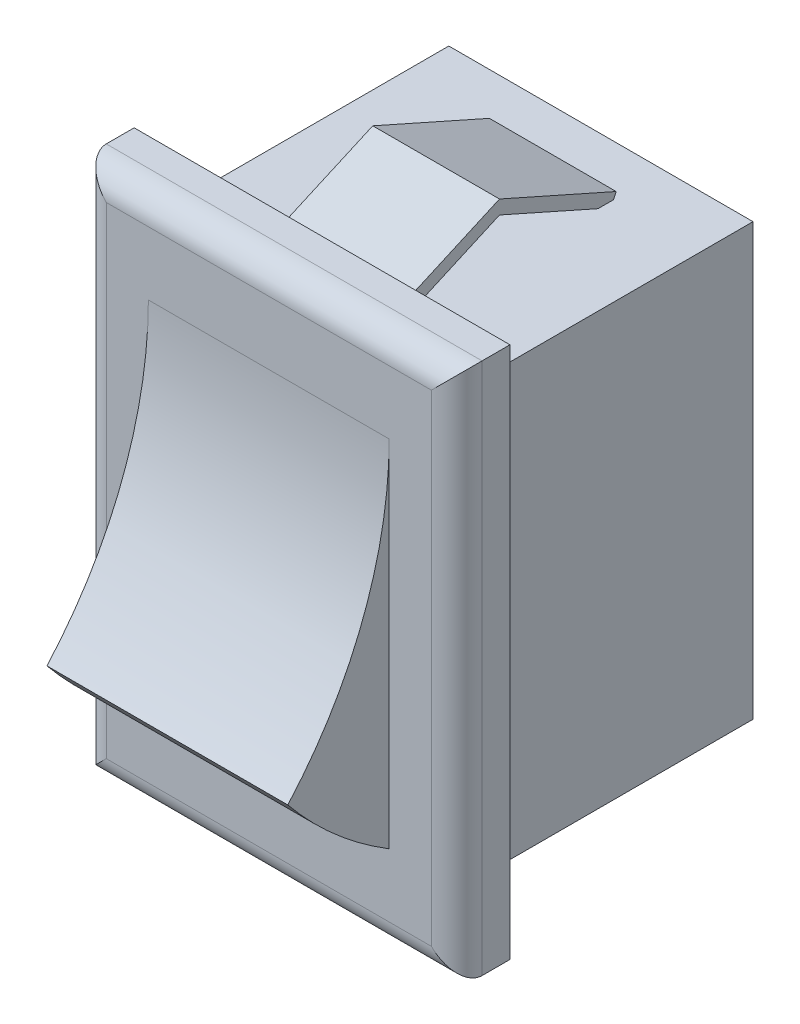
ISO-10303-21;
HEADER;
FILE_DESCRIPTION(('STEP AP214'),'2;1');
FILE_NAME('part.step','',(''),(''),'','','');
FILE_SCHEMA(('AUTOMOTIVE_DESIGN { 1 0 10303 214 1 1 1 1 }'));
ENDSEC;
DATA;
#1=APPLICATION_CONTEXT('core data for automotive mechanical design processes');
#2=APPLICATION_PROTOCOL_DEFINITION('international standard','automotive_design',2000,#1);
#3=PRODUCT_CONTEXT('',#1,'mechanical');
#4=PRODUCT('Part','Part','',(#3));
#5=PRODUCT_RELATED_PRODUCT_CATEGORY('part','',(#4));
#6=PRODUCT_DEFINITION_FORMATION('','',#4);
#7=PRODUCT_DEFINITION_CONTEXT('part definition',#1,'design');
#8=PRODUCT_DEFINITION('design','',#6,#7);
#9=PRODUCT_DEFINITION_SHAPE('','',#8);
#10=(LENGTH_UNIT() NAMED_UNIT(*) SI_UNIT(.MILLI.,.METRE.));
#11=(NAMED_UNIT(*) PLANE_ANGLE_UNIT() SI_UNIT($,.RADIAN.));
#12=(NAMED_UNIT(*) SI_UNIT($,.STERADIAN.) SOLID_ANGLE_UNIT());
#13=UNCERTAINTY_MEASURE_WITH_UNIT(LENGTH_MEASURE(1.E-05),#10,'distance_accuracy_value','');
#14=(GEOMETRIC_REPRESENTATION_CONTEXT(3) GLOBAL_UNCERTAINTY_ASSIGNED_CONTEXT((#13)) GLOBAL_UNIT_ASSIGNED_CONTEXT((#10,
#11,#12)) REPRESENTATION_CONTEXT('',''));
#15=CARTESIAN_POINT('',(0.,0.,0.));
#16=DIRECTION('',(0.,0.,1.));
#17=DIRECTION('',(1.,0.,0.));
#18=AXIS2_PLACEMENT_3D('',#15,#16,#17);
#19=CARTESIAN_POINT('',(0.,0.,11.));
#20=DIRECTION('',(0.,0.,-1.));
#21=DIRECTION('',(-1.,0.,0.));
#22=AXIS2_PLACEMENT_3D('',#19,#20,#21);
#23=PLANE('',#22);
#24=DIRECTION('',(0.,1.,0.));
#25=VECTOR('',#24,1.);
#26=CARTESIAN_POINT('',(7.41176470588235,-10.5,11.));
#27=LINE('',#26,#25);
#28=CARTESIAN_POINT('',(7.41176470588235,-10.5,11.));
#29=VERTEX_POINT('',#28);
#30=CARTESIAN_POINT('',(7.41176470588235,10.5,11.));
#31=VERTEX_POINT('',#30);
#32=EDGE_CURVE('E340',#29,#31,#27,.T.);
#33=ORIENTED_EDGE('',*,*,#32,.F.);
#34=DIRECTION('',(1.,0.,0.));
#35=VECTOR('',#34,1.);
#36=CARTESIAN_POINT('',(-7.41176470588235,-10.5,11.));
#37=LINE('',#36,#35);
#38=CARTESIAN_POINT('',(-7.41176470588235,-10.5,11.));
#39=VERTEX_POINT('',#38);
#40=EDGE_CURVE('E349',#39,#29,#37,.T.);
#41=ORIENTED_EDGE('',*,*,#40,.F.);
#42=DIRECTION('',(0.,-1.,0.));
#43=VECTOR('',#42,1.);
#44=CARTESIAN_POINT('',(-7.41176470588235,-10.5,11.));
#45=LINE('',#44,#43);
#46=CARTESIAN_POINT('',(-7.41176470588235,10.5,11.));
#47=VERTEX_POINT('',#46);
#48=EDGE_CURVE('E346',#47,#39,#45,.T.);
#49=ORIENTED_EDGE('',*,*,#48,.F.);
#50=DIRECTION('',(-1.,0.,0.));
#51=VECTOR('',#50,1.);
#52=CARTESIAN_POINT('',(-7.41176470588235,10.5,11.));
#53=LINE('',#52,#51);
#54=EDGE_CURVE('E343',#31,#47,#53,.T.);
#55=ORIENTED_EDGE('',*,*,#54,.F.);
#56=EDGE_LOOP('',(#33,#41,#49,#55));
#57=FACE_BOUND('',#56,.T.);
#58=DIRECTION('',(-1.,0.,0.));
#59=VECTOR('',#58,1.);
#60=CARTESIAN_POINT('',(-6.,8.5,11.));
#61=LINE('',#60,#59);
#62=CARTESIAN_POINT('',(6.,8.5,11.));
#63=VERTEX_POINT('',#62);
#64=CARTESIAN_POINT('',(2.5,8.5,11.));
#65=VERTEX_POINT('',#64);
#66=EDGE_CURVE('E372',#63,#65,#61,.T.);
#67=ORIENTED_EDGE('',*,*,#66,.T.);
#68=DIRECTION('',(0.,1.,0.));
#69=VECTOR('',#68,1.);
#70=CARTESIAN_POINT('',(2.5,0.,11.));
#71=LINE('',#70,#69);
#72=CARTESIAN_POINT('',(2.5,8.77357938338323,11.));
#73=VERTEX_POINT('',#72);
#74=EDGE_CURVE('E274',#65,#73,#71,.T.);
#75=ORIENTED_EDGE('',*,*,#74,.T.);
#76=DIRECTION('',(1.,0.,0.));
#77=VECTOR('',#76,1.);
#78=CARTESIAN_POINT('',(0.,8.77357938338323,11.));
#79=LINE('',#78,#77);
#80=CARTESIAN_POINT('',(-2.5,8.77357938338323,11.));
#81=VERTEX_POINT('',#80);
#82=EDGE_CURVE('E422',#81,#73,#79,.T.);
#83=ORIENTED_EDGE('',*,*,#82,.F.);
#84=DIRECTION('',(0.,1.,0.));
#85=VECTOR('',#84,1.);
#86=CARTESIAN_POINT('',(-2.5,0.,11.));
#87=LINE('',#86,#85);
#88=CARTESIAN_POINT('',(-2.5,8.5,11.));
#89=VERTEX_POINT('',#88);
#90=EDGE_CURVE('E236',#89,#81,#87,.T.);
#91=ORIENTED_EDGE('',*,*,#90,.F.);
#92=CARTESIAN_POINT('',(-6.,8.5,11.));
#93=VERTEX_POINT('',#92);
#94=EDGE_CURVE('E371',#89,#93,#61,.T.);
#95=ORIENTED_EDGE('',*,*,#94,.T.);
#96=DIRECTION('',(0.,-1.,0.));
#97=VECTOR('',#96,1.);
#98=CARTESIAN_POINT('',(-6.,-8.5,11.));
#99=LINE('',#98,#97);
#100=CARTESIAN_POINT('',(-6.,-8.5,11.));
#101=VERTEX_POINT('',#100);
#102=EDGE_CURVE('E361',#93,#101,#99,.T.);
#103=ORIENTED_EDGE('',*,*,#102,.T.);
#104=DIRECTION('',(1.,0.,0.));
#105=VECTOR('',#104,1.);
#106=CARTESIAN_POINT('',(-6.,-8.5,11.));
#107=LINE('',#106,#105);
#108=CARTESIAN_POINT('',(-2.5,-8.5,11.));
#109=VERTEX_POINT('',#108);
#110=EDGE_CURVE('E366',#101,#109,#107,.T.);
#111=ORIENTED_EDGE('',*,*,#110,.T.);
#112=DIRECTION('',(0.,1.,0.));
#113=VECTOR('',#112,1.);
#114=CARTESIAN_POINT('',(-2.5,0.,11.));
#115=LINE('',#114,#113);
#116=CARTESIAN_POINT('',(-2.5,-8.77357938338323,11.));
#117=VERTEX_POINT('',#116);
#118=EDGE_CURVE('E394',#117,#109,#115,.T.);
#119=ORIENTED_EDGE('',*,*,#118,.F.);
#120=DIRECTION('',(1.,0.,0.));
#121=VECTOR('',#120,1.);
#122=CARTESIAN_POINT('',(0.,-8.77357938338323,11.));
#123=LINE('',#122,#121);
#124=CARTESIAN_POINT('',(2.5,-8.77357938338323,11.));
#125=VERTEX_POINT('',#124);
#126=EDGE_CURVE('E397',#117,#125,#123,.T.);
#127=ORIENTED_EDGE('',*,*,#126,.T.);
#128=DIRECTION('',(0.,1.,0.));
#129=VECTOR('',#128,1.);
#130=CARTESIAN_POINT('',(2.5,0.,11.));
#131=LINE('',#130,#129);
#132=CARTESIAN_POINT('',(2.5,-8.5,11.));
#133=VERTEX_POINT('',#132);
#134=EDGE_CURVE('E399',#125,#133,#131,.T.);
#135=ORIENTED_EDGE('',*,*,#134,.T.);
#136=CARTESIAN_POINT('',(6.,-8.5,11.));
#137=VERTEX_POINT('',#136);
#138=EDGE_CURVE('E364',#133,#137,#107,.T.);
#139=ORIENTED_EDGE('',*,*,#138,.T.);
#140=DIRECTION('',(0.,1.,0.));
#141=VECTOR('',#140,1.);
#142=CARTESIAN_POINT('',(6.,-8.5,11.));
#143=LINE('',#142,#141);
#144=EDGE_CURVE('E368',#137,#63,#143,.T.);
#145=ORIENTED_EDGE('',*,*,#144,.T.);
#146=EDGE_LOOP('',(#67,#75,#83,#91,#95,#103,#111,#119,#127,#135,#139,#145));
#147=FACE_BOUND('',#146,.T.);
#148=ADVANCED_FACE('F33',(#57,#147),#23,.T.);
#149=CARTESIAN_POINT('',(-6.,8.5,11.));
#150=DIRECTION('',(0.,-1.,0.));
#151=DIRECTION('',(0.,0.,-1.));
#152=AXIS2_PLACEMENT_3D('',#149,#150,#151);
#153=PLANE('',#152);
#154=DIRECTION('',(0.,0.,-1.));
#155=VECTOR('',#154,1.);
#156=CARTESIAN_POINT('',(2.5,8.5,11.));
#157=LINE('',#156,#155);
#158=CARTESIAN_POINT('',(2.5,8.5,2.61555361261226));
#159=VERTEX_POINT('',#158);
#160=CARTESIAN_POINT('',(2.5,8.5,2.));
#161=VERTEX_POINT('',#160);
#162=EDGE_CURVE('E246',#159,#161,#157,.T.);
#163=ORIENTED_EDGE('',*,*,#162,.F.);
#164=DIRECTION('',(1.,0.,0.));
#165=VECTOR('',#164,1.);
#166=CARTESIAN_POINT('',(-6.,8.5,2.61555361261226));
#167=LINE('',#166,#165);
#168=CARTESIAN_POINT('',(-2.5,8.5,2.61555361261226));
#169=VERTEX_POINT('',#168);
#170=EDGE_CURVE('E415',#169,#159,#167,.T.);
#171=ORIENTED_EDGE('',*,*,#170,.F.);
#172=DIRECTION('',(0.,0.,-1.));
#173=VECTOR('',#172,1.);
#174=CARTESIAN_POINT('',(-2.5,8.5,11.));
#175=LINE('',#174,#173);
#176=CARTESIAN_POINT('',(-2.5,8.5,2.));
#177=VERTEX_POINT('',#176);
#178=EDGE_CURVE('E409',#169,#177,#175,.T.);
#179=ORIENTED_EDGE('',*,*,#178,.T.);
#180=DIRECTION('',(1.,0.,0.));
#181=VECTOR('',#180,1.);
#182=CARTESIAN_POINT('',(-6.,8.5,2.));
#183=LINE('',#182,#181);
#184=EDGE_CURVE('E412',#177,#161,#183,.T.);
#185=ORIENTED_EDGE('',*,*,#184,.T.);
#186=EDGE_LOOP('',(#163,#171,#179,#185));
#187=FACE_BOUND('',#186,.T.);
#188=CARTESIAN_POINT('',(2.5,8.5,10.3844463873877));
#189=VERTEX_POINT('',#188);
#190=EDGE_CURVE('E418',#65,#189,#157,.T.);
#191=ORIENTED_EDGE('',*,*,#190,.F.);
#192=ORIENTED_EDGE('',*,*,#66,.F.);
#193=DIRECTION('',(0.,0.,-1.));
#194=VECTOR('',#193,1.);
#195=CARTESIAN_POINT('',(6.,8.5,11.));
#196=LINE('',#195,#194);
#197=CARTESIAN_POINT('',(6.,8.5,0.));
#198=VERTEX_POINT('',#197);
#199=EDGE_CURVE('E385',#63,#198,#196,.T.);
#200=ORIENTED_EDGE('',*,*,#199,.T.);
#201=DIRECTION('',(-1.,0.,0.));
#202=VECTOR('',#201,1.);
#203=CARTESIAN_POINT('',(-6.,8.5,0.));
#204=LINE('',#203,#202);
#205=CARTESIAN_POINT('',(-6.,8.5,0.));
#206=VERTEX_POINT('',#205);
#207=EDGE_CURVE('E365',#198,#206,#204,.T.);
#208=ORIENTED_EDGE('',*,*,#207,.T.);
#209=DIRECTION('',(0.,0.,-1.));
#210=VECTOR('',#209,1.);
#211=CARTESIAN_POINT('',(-6.,8.5,11.));
#212=LINE('',#211,#210);
#213=EDGE_CURVE('E375',#93,#206,#212,.T.);
#214=ORIENTED_EDGE('',*,*,#213,.F.);
#215=ORIENTED_EDGE('',*,*,#94,.F.);
#216=CARTESIAN_POINT('',(-2.5,8.5,10.3844463873877));
#217=VERTEX_POINT('',#216);
#218=EDGE_CURVE('E413',#89,#217,#175,.T.);
#219=ORIENTED_EDGE('',*,*,#218,.T.);
#220=DIRECTION('',(-1.,0.,0.));
#221=VECTOR('',#220,1.);
#222=CARTESIAN_POINT('',(-6.,8.5,10.3844463873877));
#223=LINE('',#222,#221);
#224=EDGE_CURVE('E419',#189,#217,#223,.T.);
#225=ORIENTED_EDGE('',*,*,#224,.F.);
#226=EDGE_LOOP('',(#191,#192,#200,#208,#214,#215,#219,#225));
#227=FACE_BOUND('',#226,.T.);
#228=ADVANCED_FACE('F501',(#187,#227),#153,.F.);
#229=CARTESIAN_POINT('',(-6.,-8.5,11.));
#230=DIRECTION('',(0.,1.,0.));
#231=DIRECTION('',(0.,0.,1.));
#232=AXIS2_PLACEMENT_3D('',#229,#230,#231);
#233=PLANE('',#232);
#234=DIRECTION('',(0.,0.,1.));
#235=VECTOR('',#234,1.);
#236=CARTESIAN_POINT('',(2.5,-8.5,11.));
#237=LINE('',#236,#235);
#238=CARTESIAN_POINT('',(2.5,-8.5,10.3844463873877));
#239=VERTEX_POINT('',#238);
#240=EDGE_CURVE('E313',#239,#133,#237,.T.);
#241=ORIENTED_EDGE('',*,*,#240,.F.);
#242=DIRECTION('',(-1.,0.,0.));
#243=VECTOR('',#242,1.);
#244=CARTESIAN_POINT('',(-6.,-8.5,10.3844463873877));
#245=LINE('',#244,#243);
#246=CARTESIAN_POINT('',(-2.5,-8.5,10.3844463873877));
#247=VERTEX_POINT('',#246);
#248=EDGE_CURVE('E401',#239,#247,#245,.T.);
#249=ORIENTED_EDGE('',*,*,#248,.T.);
#250=DIRECTION('',(0.,0.,1.));
#251=VECTOR('',#250,1.);
#252=CARTESIAN_POINT('',(-2.5,-8.5,11.));
#253=LINE('',#252,#251);
#254=EDGE_CURVE('E309',#247,#109,#253,.T.);
#255=ORIENTED_EDGE('',*,*,#254,.T.);
#256=ORIENTED_EDGE('',*,*,#110,.F.);
#257=DIRECTION('',(0.,0.,-1.));
#258=VECTOR('',#257,1.);
#259=CARTESIAN_POINT('',(-6.,-8.5,11.));
#260=LINE('',#259,#258);
#261=CARTESIAN_POINT('',(-6.,-8.5,0.));
#262=VERTEX_POINT('',#261);
#263=EDGE_CURVE('E391',#101,#262,#260,.T.);
#264=ORIENTED_EDGE('',*,*,#263,.T.);
#265=DIRECTION('',(1.,0.,0.));
#266=VECTOR('',#265,1.);
#267=CARTESIAN_POINT('',(-6.,-8.5,0.));
#268=LINE('',#267,#266);
#269=CARTESIAN_POINT('',(6.,-8.5,0.));
#270=VERTEX_POINT('',#269);
#271=EDGE_CURVE('E378',#262,#270,#268,.T.);
#272=ORIENTED_EDGE('',*,*,#271,.T.);
#273=DIRECTION('',(0.,0.,-1.));
#274=VECTOR('',#273,1.);
#275=CARTESIAN_POINT('',(6.,-8.5,11.));
#276=LINE('',#275,#274);
#277=EDGE_CURVE('E388',#137,#270,#276,.T.);
#278=ORIENTED_EDGE('',*,*,#277,.F.);
#279=ORIENTED_EDGE('',*,*,#138,.F.);
#280=EDGE_LOOP('',(#241,#249,#255,#256,#264,#272,#278,#279));
#281=FACE_BOUND('',#280,.T.);
#282=CARTESIAN_POINT('',(2.5,-8.5,2.));
#283=VERTEX_POINT('',#282);
#284=CARTESIAN_POINT('',(2.5,-8.5,2.61555361261226));
#285=VERTEX_POINT('',#284);
#286=EDGE_CURVE('E316',#283,#285,#237,.T.);
#287=ORIENTED_EDGE('',*,*,#286,.F.);
#288=DIRECTION('',(-1.,0.,0.));
#289=VECTOR('',#288,1.);
#290=CARTESIAN_POINT('',(-6.,-8.5,2.));
#291=LINE('',#290,#289);
#292=CARTESIAN_POINT('',(-2.5,-8.5,2.));
#293=VERTEX_POINT('',#292);
#294=EDGE_CURVE('E406',#283,#293,#291,.T.);
#295=ORIENTED_EDGE('',*,*,#294,.T.);
#296=CARTESIAN_POINT('',(-2.5,-8.5,2.61555361261226));
#297=VERTEX_POINT('',#296);
#298=EDGE_CURVE('E312',#293,#297,#253,.T.);
#299=ORIENTED_EDGE('',*,*,#298,.T.);
#300=DIRECTION('',(1.,0.,0.));
#301=VECTOR('',#300,1.);
#302=CARTESIAN_POINT('',(-6.,-8.5,2.61555361261225));
#303=LINE('',#302,#301);
#304=EDGE_CURVE('E403',#297,#285,#303,.T.);
#305=ORIENTED_EDGE('',*,*,#304,.T.);
#306=EDGE_LOOP('',(#287,#295,#299,#305));
#307=FACE_BOUND('',#306,.T.);
#308=ADVANCED_FACE('F507',(#281,#307),#233,.F.);
#309=CARTESIAN_POINT('',(-6.,-8.5,11.));
#310=DIRECTION('',(1.,0.,0.));
#311=DIRECTION('',(0.,0.,-1.));
#312=AXIS2_PLACEMENT_3D('',#309,#310,#311);
#313=PLANE('',#312);
#314=DIRECTION('',(0.,-1.,0.));
#315=VECTOR('',#314,1.);
#316=CARTESIAN_POINT('',(-6.,-8.5,0.));
#317=LINE('',#316,#315);
#318=EDGE_CURVE('E360',#206,#262,#317,.T.);
#319=ORIENTED_EDGE('',*,*,#318,.T.);
#320=ORIENTED_EDGE('',*,*,#263,.F.);
#321=ORIENTED_EDGE('',*,*,#102,.F.);
#322=ORIENTED_EDGE('',*,*,#213,.T.);
#323=EDGE_LOOP('',(#319,#320,#321,#322));
#324=FACE_BOUND('',#323,.T.);
#325=ADVANCED_FACE('F530',(#324),#313,.F.);
#326=CARTESIAN_POINT('',(6.,-8.5,11.));
#327=DIRECTION('',(-1.,0.,0.));
#328=DIRECTION('',(0.,0.,1.));
#329=AXIS2_PLACEMENT_3D('',#326,#327,#328);
#330=PLANE('',#329);
#331=DIRECTION('',(0.,1.,0.));
#332=VECTOR('',#331,1.);
#333=CARTESIAN_POINT('',(6.,-8.5,0.));
#334=LINE('',#333,#332);
#335=EDGE_CURVE('E380',#270,#198,#334,.T.);
#336=ORIENTED_EDGE('',*,*,#335,.T.);
#337=ORIENTED_EDGE('',*,*,#199,.F.);
#338=ORIENTED_EDGE('',*,*,#144,.F.);
#339=ORIENTED_EDGE('',*,*,#277,.T.);
#340=EDGE_LOOP('',(#336,#337,#338,#339));
#341=FACE_BOUND('',#340,.T.);
#342=ADVANCED_FACE('F525',(#341),#330,.F.);
#343=CARTESIAN_POINT('',(0.,0.,0.));
#344=DIRECTION('',(0.,0.,-1.));
#345=DIRECTION('',(-1.,0.,0.));
#346=AXIS2_PLACEMENT_3D('',#343,#344,#345);
#347=PLANE('',#346);
#348=ORIENTED_EDGE('',*,*,#318,.F.);
#349=ORIENTED_EDGE('',*,*,#207,.F.);
#350=ORIENTED_EDGE('',*,*,#335,.F.);
#351=ORIENTED_EDGE('',*,*,#271,.F.);
#352=EDGE_LOOP('',(#348,#349,#350,#351));
#353=FACE_BOUND('',#352,.T.);
#354=ADVANCED_FACE('F523',(#353),#347,.T.);
#355=CARTESIAN_POINT('',(7.41176470588235,-10.5,13.1));
#356=DIRECTION('',(-1.,0.,0.));
#357=DIRECTION('',(0.,0.,1.));
#358=AXIS2_PLACEMENT_3D('',#355,#356,#357);
#359=PLANE('',#358);
#360=DIRECTION('',(0.,0.,-1.));
#361=VECTOR('',#360,1.);
#362=CARTESIAN_POINT('',(7.41176470588235,10.5,13.1));
#363=LINE('',#362,#361);
#364=CARTESIAN_POINT('',(7.41176470588235,10.5,12.1));
#365=VERTEX_POINT('',#364);
#366=EDGE_CURVE('E358',#365,#31,#363,.T.);
#367=ORIENTED_EDGE('',*,*,#366,.F.);
#368=DIRECTION('',(0.,1.,0.));
#369=VECTOR('',#368,1.);
#370=CARTESIAN_POINT('',(7.41176470588235,-10.5,12.1));
#371=LINE('',#370,#369);
#372=CARTESIAN_POINT('',(7.41176470588235,-10.5,12.1));
#373=VERTEX_POINT('',#372);
#374=EDGE_CURVE('E42',#365,#373,#371,.F.);
#375=ORIENTED_EDGE('',*,*,#374,.T.);
#376=DIRECTION('',(0.,0.,-1.));
#377=VECTOR('',#376,1.);
#378=CARTESIAN_POINT('',(7.41176470588235,-10.5,13.1));
#379=LINE('',#378,#377);
#380=EDGE_CURVE('E352',#373,#29,#379,.T.);
#381=ORIENTED_EDGE('',*,*,#380,.T.);
#382=ORIENTED_EDGE('',*,*,#32,.T.);
#383=EDGE_LOOP('',(#367,#375,#381,#382));
#384=FACE_BOUND('',#383,.T.);
#385=ADVANCED_FACE('F459',(#384),#359,.F.);
#386=CARTESIAN_POINT('',(-7.41176470588235,10.5,13.1));
#387=DIRECTION('',(0.,-1.,0.));
#388=DIRECTION('',(1.,0.,0.));
#389=AXIS2_PLACEMENT_3D('',#386,#387,#388);
#390=PLANE('',#389);
#391=DIRECTION('',(0.,0.,-1.));
#392=VECTOR('',#391,1.);
#393=CARTESIAN_POINT('',(-7.41176470588235,10.5,13.1));
#394=LINE('',#393,#392);
#395=CARTESIAN_POINT('',(-7.41176470588235,10.5,12.1));
#396=VERTEX_POINT('',#395);
#397=EDGE_CURVE('E356',#396,#47,#394,.T.);
#398=ORIENTED_EDGE('',*,*,#397,.F.);
#399=DIRECTION('',(-1.,0.,0.));
#400=VECTOR('',#399,1.);
#401=CARTESIAN_POINT('',(-7.41176470588235,10.5,12.1));
#402=LINE('',#401,#400);
#403=EDGE_CURVE('E11',#396,#365,#402,.F.);
#404=ORIENTED_EDGE('',*,*,#403,.T.);
#405=ORIENTED_EDGE('',*,*,#366,.T.);
#406=ORIENTED_EDGE('',*,*,#54,.T.);
#407=EDGE_LOOP('',(#398,#404,#405,#406));
#408=FACE_BOUND('',#407,.T.);
#409=ADVANCED_FACE('F518',(#408),#390,.F.);
#410=CARTESIAN_POINT('',(-7.41176470588235,-10.5,13.1));
#411=DIRECTION('',(1.,0.,0.));
#412=DIRECTION('',(0.,0.,-1.));
#413=AXIS2_PLACEMENT_3D('',#410,#411,#412);
#414=PLANE('',#413);
#415=DIRECTION('',(0.,0.,-1.));
#416=VECTOR('',#415,1.);
#417=CARTESIAN_POINT('',(-7.41176470588235,-10.5,13.1));
#418=LINE('',#417,#416);
#419=CARTESIAN_POINT('',(-7.41176470588235,-10.5,12.1));
#420=VERTEX_POINT('',#419);
#421=EDGE_CURVE('E354',#420,#39,#418,.T.);
#422=ORIENTED_EDGE('',*,*,#421,.F.);
#423=DIRECTION('',(0.,-1.,0.));
#424=VECTOR('',#423,1.);
#425=CARTESIAN_POINT('',(-7.41176470588235,-10.5,12.1));
#426=LINE('',#425,#424);
#427=EDGE_CURVE('E56',#420,#396,#426,.F.);
#428=ORIENTED_EDGE('',*,*,#427,.T.);
#429=ORIENTED_EDGE('',*,*,#397,.T.);
#430=ORIENTED_EDGE('',*,*,#48,.T.);
#431=EDGE_LOOP('',(#422,#428,#429,#430));
#432=FACE_BOUND('',#431,.T.);
#433=ADVANCED_FACE('F515',(#432),#414,.F.);
#434=CARTESIAN_POINT('',(-7.41176470588235,-10.5,13.1));
#435=DIRECTION('',(0.,1.,0.));
#436=DIRECTION('',(-1.,0.,0.));
#437=AXIS2_PLACEMENT_3D('',#434,#435,#436);
#438=PLANE('',#437);
#439=ORIENTED_EDGE('',*,*,#380,.F.);
#440=DIRECTION('',(1.,0.,0.));
#441=VECTOR('',#440,1.);
#442=CARTESIAN_POINT('',(-7.41176470588235,-10.5,12.1));
#443=LINE('',#442,#441);
#444=EDGE_CURVE('E433',#373,#420,#443,.F.);
#445=ORIENTED_EDGE('',*,*,#444,.T.);
#446=ORIENTED_EDGE('',*,*,#421,.T.);
#447=ORIENTED_EDGE('',*,*,#40,.T.);
#448=EDGE_LOOP('',(#439,#445,#446,#447));
#449=FACE_BOUND('',#448,.T.);
#450=ADVANCED_FACE('F462',(#449),#438,.F.);
#451=CARTESIAN_POINT('',(0.,0.,13.1));
#452=DIRECTION('',(0.,0.,-1.));
#453=DIRECTION('',(-1.,0.,0.));
#454=AXIS2_PLACEMENT_3D('',#451,#452,#453);
#455=PLANE('',#454);
#456=DIRECTION('',(0.,-1.,0.));
#457=VECTOR('',#456,1.);
#458=CARTESIAN_POINT('',(-6.41176470588235,0.,13.1));
#459=LINE('',#458,#457);
#460=CARTESIAN_POINT('',(-6.41176470588235,9.50000000000001,13.1));
#461=VERTEX_POINT('',#460);
#462=CARTESIAN_POINT('',(-6.41176470588235,-9.5,13.1));
#463=VERTEX_POINT('',#462);
#464=EDGE_CURVE('E428',#461,#463,#459,.T.);
#465=ORIENTED_EDGE('',*,*,#464,.T.);
#466=DIRECTION('',(1.,0.,0.));
#467=VECTOR('',#466,1.);
#468=CARTESIAN_POINT('',(0.,-9.5,13.1));
#469=LINE('',#468,#467);
#470=CARTESIAN_POINT('',(6.41176470588235,-9.49999999999999,13.1));
#471=VERTEX_POINT('',#470);
#472=EDGE_CURVE('E430',#463,#471,#469,.T.);
#473=ORIENTED_EDGE('',*,*,#472,.T.);
#474=DIRECTION('',(0.,1.,0.));
#475=VECTOR('',#474,1.);
#476=CARTESIAN_POINT('',(6.41176470588235,0.,13.1));
#477=LINE('',#476,#475);
#478=CARTESIAN_POINT('',(6.41176470588235,9.5,13.1));
#479=VERTEX_POINT('',#478);
#480=EDGE_CURVE('E426',#471,#479,#477,.T.);
#481=ORIENTED_EDGE('',*,*,#480,.T.);
#482=DIRECTION('',(-1.,0.,0.));
#483=VECTOR('',#482,1.);
#484=CARTESIAN_POINT('',(0.,9.5,13.1));
#485=LINE('',#484,#483);
#486=EDGE_CURVE('E424',#479,#461,#485,.T.);
#487=ORIENTED_EDGE('',*,*,#486,.T.);
#488=EDGE_LOOP('',(#465,#473,#481,#487));
#489=FACE_BOUND('',#488,.T.);
#490=DIRECTION('',(-1.,0.,0.));
#491=VECTOR('',#490,1.);
#492=CARTESIAN_POINT('',(4.75,7.,13.1));
#493=LINE('',#492,#491);
#494=CARTESIAN_POINT('',(4.75,7.,13.1));
#495=VERTEX_POINT('',#494);
#496=CARTESIAN_POINT('',(-4.75,7.,13.1));
#497=VERTEX_POINT('',#496);
#498=EDGE_CURVE('E335',#495,#497,#493,.T.);
#499=ORIENTED_EDGE('',*,*,#498,.F.);
#500=DIRECTION('',(0.,1.,0.));
#501=VECTOR('',#500,1.);
#502=CARTESIAN_POINT('',(4.75,-7.,13.1));
#503=LINE('',#502,#501);
#504=CARTESIAN_POINT('',(4.75,-7.,13.1));
#505=VERTEX_POINT('',#504);
#506=EDGE_CURVE('E320',#505,#495,#503,.T.);
#507=ORIENTED_EDGE('',*,*,#506,.F.);
#508=DIRECTION('',(-1.,0.,0.));
#509=VECTOR('',#508,1.);
#510=CARTESIAN_POINT('',(4.75,-7.,13.1));
#511=LINE('',#510,#509);
#512=CARTESIAN_POINT('',(-4.75,-7.,13.1));
#513=VERTEX_POINT('',#512);
#514=EDGE_CURVE('E338',#505,#513,#511,.T.);
#515=ORIENTED_EDGE('',*,*,#514,.T.);
#516=DIRECTION('',(0.,1.,0.));
#517=VECTOR('',#516,1.);
#518=CARTESIAN_POINT('',(-4.75,-7.,13.1));
#519=LINE('',#518,#517);
#520=EDGE_CURVE('E330',#513,#497,#519,.T.);
#521=ORIENTED_EDGE('',*,*,#520,.T.);
#522=EDGE_LOOP('',(#499,#507,#515,#521));
#523=FACE_BOUND('',#522,.T.);
#524=ADVANCED_FACE('F469',(#489,#523),#455,.F.);
#525=CARTESIAN_POINT('',(4.75,6.45699151970642,4.85638242025689));
#526=DIRECTION('',(-1.,0.,0.));
#527=DIRECTION('',(0.,0.,1.));
#528=AXIS2_PLACEMENT_3D('',#525,#526,#527);
#529=CYLINDRICAL_SURFACE('',#528,15.78125);
#530=CARTESIAN_POINT('',(-4.75,6.45699151970642,4.85638242025689));
#531=DIRECTION('',(1.,0.,0.));
#532=DIRECTION('',(0.,0.,-1.));
#533=AXIS2_PLACEMENT_3D('',#530,#531,#532);
#534=CIRCLE('',#533,15.78125);
#535=CARTESIAN_POINT('',(-4.75,-3.49999999999999,17.1));
#536=VERTEX_POINT('',#535);
#537=EDGE_CURVE('E327',#536,#513,#534,.T.);
#538=ORIENTED_EDGE('',*,*,#537,.T.);
#539=ORIENTED_EDGE('',*,*,#514,.F.);
#540=CARTESIAN_POINT('',(4.75,6.45699151970642,4.85638242025689));
#541=DIRECTION('',(1.,0.,0.));
#542=DIRECTION('',(0.,0.,-1.));
#543=AXIS2_PLACEMENT_3D('',#540,#541,#542);
#544=CIRCLE('',#543,15.78125);
#545=CARTESIAN_POINT('',(4.75,-3.49999999999999,17.1));
#546=VERTEX_POINT('',#545);
#547=EDGE_CURVE('E317',#546,#505,#544,.T.);
#548=ORIENTED_EDGE('',*,*,#547,.F.);
#549=DIRECTION('',(-1.,0.,0.));
#550=VECTOR('',#549,1.);
#551=CARTESIAN_POINT('',(4.75,-3.49999999999999,17.1));
#552=LINE('',#551,#550);
#553=EDGE_CURVE('E326',#546,#536,#552,.T.);
#554=ORIENTED_EDGE('',*,*,#553,.T.);
#555=EDGE_LOOP('',(#538,#539,#548,#554));
#556=FACE_BOUND('',#555,.T.);
#557=ADVANCED_FACE('F472',(#556),#529,.T.);
#558=CARTESIAN_POINT('',(4.75,7.,28.88125));
#559=DIRECTION('',(-1.,0.,0.));
#560=DIRECTION('',(0.,0.,1.));
#561=AXIS2_PLACEMENT_3D('',#558,#559,#560);
#562=CYLINDRICAL_SURFACE('',#561,15.78125);
#563=CARTESIAN_POINT('',(-4.75,7.,28.88125));
#564=DIRECTION('',(-1.,0.,0.));
#565=DIRECTION('',(0.,0.,-1.));
#566=AXIS2_PLACEMENT_3D('',#563,#564,#565);
#567=CIRCLE('',#566,15.78125);
#568=EDGE_CURVE('E321',#497,#536,#567,.T.);
#569=ORIENTED_EDGE('',*,*,#568,.T.);
#570=ORIENTED_EDGE('',*,*,#553,.F.);
#571=CARTESIAN_POINT('',(4.75,7.,28.88125));
#572=DIRECTION('',(-1.,0.,0.));
#573=DIRECTION('',(0.,0.,-1.));
#574=AXIS2_PLACEMENT_3D('',#571,#572,#573);
#575=CIRCLE('',#574,15.78125);
#576=EDGE_CURVE('E324',#495,#546,#575,.T.);
#577=ORIENTED_EDGE('',*,*,#576,.F.);
#578=ORIENTED_EDGE('',*,*,#498,.T.);
#579=EDGE_LOOP('',(#569,#570,#577,#578));
#580=FACE_BOUND('',#579,.T.);
#581=ADVANCED_FACE('F483',(#580),#562,.F.);
#582=CARTESIAN_POINT('',(4.75,6.45699151970642,4.85638242025689));
#583=DIRECTION('',(1.,0.,0.));
#584=DIRECTION('',(0.,0.,-1.));
#585=AXIS2_PLACEMENT_3D('',#582,#583,#584);
#586=PLANE('',#585);
#587=ORIENTED_EDGE('',*,*,#547,.T.);
#588=ORIENTED_EDGE('',*,*,#506,.T.);
#589=ORIENTED_EDGE('',*,*,#576,.T.);
#590=EDGE_LOOP('',(#587,#588,#589));
#591=FACE_BOUND('',#590,.T.);
#592=ADVANCED_FACE('F479',(#591),#586,.T.);
#593=CARTESIAN_POINT('',(-4.75,6.45699151970642,4.85638242025689));
#594=DIRECTION('',(1.,0.,0.));
#595=DIRECTION('',(0.,0.,-1.));
#596=AXIS2_PLACEMENT_3D('',#593,#594,#595);
#597=PLANE('',#596);
#598=ORIENTED_EDGE('',*,*,#537,.F.);
#599=ORIENTED_EDGE('',*,*,#568,.F.);
#600=ORIENTED_EDGE('',*,*,#520,.F.);
#601=EDGE_LOOP('',(#598,#599,#600));
#602=FACE_BOUND('',#601,.T.);
#603=ADVANCED_FACE('F487',(#602),#597,.F.);
#604=CARTESIAN_POINT('',(2.5,-8.27154711284494,2.10153461651336));
#605=DIRECTION('',(0.,0.406138466053448,-0.913811548620257));
#606=DIRECTION('',(0.,0.913811548620257,0.406138466053448));
#607=AXIS2_PLACEMENT_3D('',#604,#605,#606);
#608=PLANE('',#607);
#609=ORIENTED_EDGE('',*,*,#294,.F.);
#610=DIRECTION('',(0.,-0.913811548620257,-0.406138466053448));
#611=VECTOR('',#610,1.);
#612=CARTESIAN_POINT('',(2.5,-8.27154711284494,2.10153461651336));
#613=LINE('',#612,#611);
#614=CARTESIAN_POINT('',(2.5,-8.72845288715506,1.89846538348664));
#615=VERTEX_POINT('',#614);
#616=EDGE_CURVE('E281',#283,#615,#613,.T.);
#617=ORIENTED_EDGE('',*,*,#616,.T.);
#618=DIRECTION('',(-1.,0.,0.));
#619=VECTOR('',#618,1.);
#620=CARTESIAN_POINT('',(2.5,-8.72845288715506,1.89846538348664));
#621=LINE('',#620,#619);
#622=CARTESIAN_POINT('',(-2.5,-8.72845288715506,1.89846538348664));
#623=VERTEX_POINT('',#622);
#624=EDGE_CURVE('E306',#615,#623,#621,.T.);
#625=ORIENTED_EDGE('',*,*,#624,.T.);
#626=DIRECTION('',(0.,-0.913811548620257,-0.406138466053448));
#627=VECTOR('',#626,1.);
#628=CARTESIAN_POINT('',(-2.5,-8.27154711284494,2.10153461651336));
#629=LINE('',#628,#627);
#630=EDGE_CURVE('E294',#293,#623,#629,.T.);
#631=ORIENTED_EDGE('',*,*,#630,.F.);
#632=EDGE_LOOP('',(#609,#617,#625,#631));
#633=FACE_BOUND('',#632,.T.);
#634=ADVANCED_FACE('F489',(#633),#608,.T.);
#635=CARTESIAN_POINT('',(2.5,-10.2715471128449,6.60153461651336));
#636=DIRECTION('',(0.,0.913811548620257,0.406138466053448));
#637=DIRECTION('',(0.,-0.406138466053448,0.913811548620257));
#638=AXIS2_PLACEMENT_3D('',#635,#636,#637);
#639=PLANE('',#638);
#640=ORIENTED_EDGE('',*,*,#304,.F.);
#641=DIRECTION('',(0.,0.406138466053448,-0.913811548620257));
#642=VECTOR('',#641,1.);
#643=CARTESIAN_POINT('',(-2.5,-10.2715471128449,6.60153461651336));
#644=LINE('',#643,#642);
#645=CARTESIAN_POINT('',(-2.5,-10.2264206166168,6.5));
#646=VERTEX_POINT('',#645);
#647=EDGE_CURVE('E296',#646,#297,#644,.T.);
#648=ORIENTED_EDGE('',*,*,#647,.F.);
#649=DIRECTION('',(-1.,0.,0.));
#650=VECTOR('',#649,1.);
#651=CARTESIAN_POINT('',(2.5,-10.2264206166168,6.5));
#652=LINE('',#651,#650);
#653=CARTESIAN_POINT('',(2.5,-10.2264206166168,6.5));
#654=VERTEX_POINT('',#653);
#655=EDGE_CURVE('E303',#654,#646,#652,.T.);
#656=ORIENTED_EDGE('',*,*,#655,.F.);
#657=DIRECTION('',(0.,0.406138466053448,-0.913811548620257));
#658=VECTOR('',#657,1.);
#659=CARTESIAN_POINT('',(2.5,-10.2715471128449,6.60153461651336));
#660=LINE('',#659,#658);
#661=EDGE_CURVE('E284',#654,#285,#660,.T.);
#662=ORIENTED_EDGE('',*,*,#661,.T.);
#663=EDGE_LOOP('',(#640,#648,#656,#662));
#664=FACE_BOUND('',#663,.T.);
#665=ADVANCED_FACE('F495',(#664),#639,.T.);
#666=CARTESIAN_POINT('',(2.5,-8.27154711284494,10.8984653834866));
#667=DIRECTION('',(0.,0.913811548620257,-0.406138466053448));
#668=DIRECTION('',(0.,0.406138466053448,0.913811548620257));
#669=AXIS2_PLACEMENT_3D('',#666,#667,#668);
#670=PLANE('',#669);
#671=ORIENTED_EDGE('',*,*,#248,.F.);
#672=DIRECTION('',(0.,-0.406138466053448,-0.913811548620257));
#673=VECTOR('',#672,1.);
#674=CARTESIAN_POINT('',(2.5,-8.27154711284494,10.8984653834866));
#675=LINE('',#674,#673);
#676=EDGE_CURVE('E287',#239,#654,#675,.T.);
#677=ORIENTED_EDGE('',*,*,#676,.T.);
#678=ORIENTED_EDGE('',*,*,#655,.T.);
#679=DIRECTION('',(0.,-0.406138466053448,-0.913811548620257));
#680=VECTOR('',#679,1.);
#681=CARTESIAN_POINT('',(-2.5,-8.27154711284494,10.8984653834866));
#682=LINE('',#681,#680);
#683=EDGE_CURVE('E298',#247,#646,#682,.T.);
#684=ORIENTED_EDGE('',*,*,#683,.F.);
#685=EDGE_LOOP('',(#671,#677,#678,#684));
#686=FACE_BOUND('',#685,.T.);
#687=ADVANCED_FACE('F572',(#686),#670,.T.);
#688=CARTESIAN_POINT('',(2.5,0.,0.));
#689=DIRECTION('',(-1.,0.,0.));
#690=DIRECTION('',(0.,0.,1.));
#691=AXIS2_PLACEMENT_3D('',#688,#689,#690);
#692=PLANE('',#691);
#693=ORIENTED_EDGE('',*,*,#616,.F.);
#694=ORIENTED_EDGE('',*,*,#286,.T.);
#695=ORIENTED_EDGE('',*,*,#661,.F.);
#696=ORIENTED_EDGE('',*,*,#676,.F.);
#697=ORIENTED_EDGE('',*,*,#240,.T.);
#698=ORIENTED_EDGE('',*,*,#134,.F.);
#699=DIRECTION('',(0.,-0.406138466053448,-0.913811548620257));
#700=VECTOR('',#699,1.);
#701=CARTESIAN_POINT('',(2.5,-8.72845288715506,11.1015346165134));
#702=LINE('',#701,#700);
#703=CARTESIAN_POINT('',(2.5,-10.7735793833832,6.5));
#704=VERTEX_POINT('',#703);
#705=EDGE_CURVE('E289',#125,#704,#702,.T.);
#706=ORIENTED_EDGE('',*,*,#705,.T.);
#707=DIRECTION('',(0.,0.406138466053448,-0.913811548620257));
#708=VECTOR('',#707,1.);
#709=CARTESIAN_POINT('',(2.5,-10.7284528871551,6.39846538348664));
#710=LINE('',#709,#708);
#711=EDGE_CURVE('E278',#704,#615,#710,.T.);
#712=ORIENTED_EDGE('',*,*,#711,.T.);
#713=EDGE_LOOP('',(#693,#694,#695,#696,#697,#698,#706,#712));
#714=FACE_BOUND('',#713,.T.);
#715=ADVANCED_FACE('F568',(#714),#692,.F.);
#716=CARTESIAN_POINT('',(-2.5,0.,0.));
#717=DIRECTION('',(-1.,0.,0.));
#718=DIRECTION('',(0.,0.,1.));
#719=AXIS2_PLACEMENT_3D('',#716,#717,#718);
#720=PLANE('',#719);
#721=ORIENTED_EDGE('',*,*,#298,.F.);
#722=ORIENTED_EDGE('',*,*,#630,.T.);
#723=DIRECTION('',(0.,0.406138466053448,-0.913811548620257));
#724=VECTOR('',#723,1.);
#725=CARTESIAN_POINT('',(-2.5,-10.7284528871551,6.39846538348664));
#726=LINE('',#725,#724);
#727=CARTESIAN_POINT('',(-2.5,-10.7735793833832,6.5));
#728=VERTEX_POINT('',#727);
#729=EDGE_CURVE('E277',#728,#623,#726,.T.);
#730=ORIENTED_EDGE('',*,*,#729,.F.);
#731=DIRECTION('',(0.,-0.406138466053448,-0.913811548620257));
#732=VECTOR('',#731,1.);
#733=CARTESIAN_POINT('',(-2.5,-8.72845288715506,11.1015346165134));
#734=LINE('',#733,#732);
#735=EDGE_CURVE('E282',#117,#728,#734,.T.);
#736=ORIENTED_EDGE('',*,*,#735,.F.);
#737=ORIENTED_EDGE('',*,*,#118,.T.);
#738=ORIENTED_EDGE('',*,*,#254,.F.);
#739=ORIENTED_EDGE('',*,*,#683,.T.);
#740=ORIENTED_EDGE('',*,*,#647,.T.);
#741=EDGE_LOOP('',(#721,#722,#730,#736,#737,#738,#739,#740));
#742=FACE_BOUND('',#741,.T.);
#743=ADVANCED_FACE('F571',(#742),#720,.T.);
#744=CARTESIAN_POINT('',(2.5,-10.7284528871551,6.39846538348664));
#745=DIRECTION('',(0.,0.913811548620257,0.406138466053448));
#746=DIRECTION('',(0.,-0.406138466053448,0.913811548620257));
#747=AXIS2_PLACEMENT_3D('',#744,#745,#746);
#748=PLANE('',#747);
#749=ORIENTED_EDGE('',*,*,#729,.T.);
#750=ORIENTED_EDGE('',*,*,#624,.F.);
#751=ORIENTED_EDGE('',*,*,#711,.F.);
#752=DIRECTION('',(-1.,0.,0.));
#753=VECTOR('',#752,1.);
#754=CARTESIAN_POINT('',(2.5,-10.7735793833832,6.5));
#755=LINE('',#754,#753);
#756=EDGE_CURVE('E291',#704,#728,#755,.T.);
#757=ORIENTED_EDGE('',*,*,#756,.T.);
#758=EDGE_LOOP('',(#749,#750,#751,#757));
#759=FACE_BOUND('',#758,.T.);
#760=ADVANCED_FACE('F576',(#759),#748,.F.);
#761=CARTESIAN_POINT('',(2.5,-8.72845288715506,11.1015346165134));
#762=DIRECTION('',(0.,0.913811548620257,-0.406138466053448));
#763=DIRECTION('',(0.,0.406138466053448,0.913811548620257));
#764=AXIS2_PLACEMENT_3D('',#761,#762,#763);
#765=PLANE('',#764);
#766=ORIENTED_EDGE('',*,*,#126,.F.);
#767=ORIENTED_EDGE('',*,*,#735,.T.);
#768=ORIENTED_EDGE('',*,*,#756,.F.);
#769=ORIENTED_EDGE('',*,*,#705,.F.);
#770=EDGE_LOOP('',(#766,#767,#768,#769));
#771=FACE_BOUND('',#770,.T.);
#772=ADVANCED_FACE('F566',(#771),#765,.F.);
#773=CARTESIAN_POINT('',(2.5,10.2715471128449,6.60153461651336));
#774=DIRECTION('',(0.,0.913811548620257,-0.406138466053448));
#775=DIRECTION('',(0.,0.406138466053448,0.913811548620257));
#776=AXIS2_PLACEMENT_3D('',#773,#774,#775);
#777=PLANE('',#776);
#778=DIRECTION('',(0.,-0.406138466053448,-0.913811548620257));
#779=VECTOR('',#778,1.);
#780=CARTESIAN_POINT('',(-2.5,10.2715471128449,6.60153461651336));
#781=LINE('',#780,#779);
#782=CARTESIAN_POINT('',(-2.5,10.2264206166168,6.5));
#783=VERTEX_POINT('',#782);
#784=EDGE_CURVE('E260',#783,#169,#781,.T.);
#785=ORIENTED_EDGE('',*,*,#784,.T.);
#786=ORIENTED_EDGE('',*,*,#170,.T.);
#787=DIRECTION('',(0.,-0.406138466053448,-0.913811548620257));
#788=VECTOR('',#787,1.);
#789=CARTESIAN_POINT('',(2.5,10.2715471128449,6.60153461651336));
#790=LINE('',#789,#788);
#791=CARTESIAN_POINT('',(2.5,10.2264206166168,6.5));
#792=VERTEX_POINT('',#791);
#793=EDGE_CURVE('E247',#792,#159,#790,.T.);
#794=ORIENTED_EDGE('',*,*,#793,.F.);
#795=DIRECTION('',(-1.,0.,0.));
#796=VECTOR('',#795,1.);
#797=CARTESIAN_POINT('',(2.5,10.2264206166168,6.5));
#798=LINE('',#797,#796);
#799=EDGE_CURVE('E259',#792,#783,#798,.T.);
#800=ORIENTED_EDGE('',*,*,#799,.T.);
#801=EDGE_LOOP('',(#785,#786,#794,#800));
#802=FACE_BOUND('',#801,.T.);
#803=ADVANCED_FACE('F563',(#802),#777,.F.);
#804=CARTESIAN_POINT('',(2.5,8.72845288715506,1.89846538348664));
#805=DIRECTION('',(0.,-0.40613846605345,-0.913811548620256));
#806=DIRECTION('',(0.,0.913811548620256,-0.406138466053451));
#807=AXIS2_PLACEMENT_3D('',#804,#805,#806);
#808=PLANE('',#807);
#809=ORIENTED_EDGE('',*,*,#184,.F.);
#810=DIRECTION('',(0.,-0.913811548620256,0.40613846605345));
#811=VECTOR('',#810,1.);
#812=CARTESIAN_POINT('',(-2.5,8.72845288715506,1.89846538348664));
#813=LINE('',#812,#811);
#814=CARTESIAN_POINT('',(-2.5,8.72845288715506,1.89846538348664));
#815=VERTEX_POINT('',#814);
#816=EDGE_CURVE('E231',#815,#177,#813,.T.);
#817=ORIENTED_EDGE('',*,*,#816,.F.);
#818=DIRECTION('',(-1.,0.,0.));
#819=VECTOR('',#818,1.);
#820=CARTESIAN_POINT('',(2.5,8.72845288715506,1.89846538348664));
#821=LINE('',#820,#819);
#822=CARTESIAN_POINT('',(2.5,8.72845288715506,1.89846538348664));
#823=VERTEX_POINT('',#822);
#824=EDGE_CURVE('E225',#823,#815,#821,.T.);
#825=ORIENTED_EDGE('',*,*,#824,.F.);
#826=DIRECTION('',(0.,-0.913811548620256,0.40613846605345));
#827=VECTOR('',#826,1.);
#828=CARTESIAN_POINT('',(2.5,8.72845288715506,1.89846538348664));
#829=LINE('',#828,#827);
#830=EDGE_CURVE('E229',#823,#161,#829,.T.);
#831=ORIENTED_EDGE('',*,*,#830,.T.);
#832=EDGE_LOOP('',(#809,#817,#825,#831));
#833=FACE_BOUND('',#832,.T.);
#834=ADVANCED_FACE('F228',(#833),#808,.T.);
#835=CARTESIAN_POINT('',(2.5,8.27154711284494,10.8984653834866));
#836=DIRECTION('',(0.,0.913811548620257,0.406138466053448));
#837=DIRECTION('',(0.,-0.406138466053448,0.913811548620257));
#838=AXIS2_PLACEMENT_3D('',#835,#836,#837);
#839=PLANE('',#838);
#840=DIRECTION('',(0.,0.406138466053448,-0.913811548620257));
#841=VECTOR('',#840,1.);
#842=CARTESIAN_POINT('',(2.5,8.27154711284494,10.8984653834866));
#843=LINE('',#842,#841);
#844=EDGE_CURVE('E254',#189,#792,#843,.T.);
#845=ORIENTED_EDGE('',*,*,#844,.F.);
#846=ORIENTED_EDGE('',*,*,#224,.T.);
#847=DIRECTION('',(0.,0.406138466053448,-0.913811548620257));
#848=VECTOR('',#847,1.);
#849=CARTESIAN_POINT('',(-2.5,8.27154711284494,10.8984653834866));
#850=LINE('',#849,#848);
#851=EDGE_CURVE('E268',#217,#783,#850,.T.);
#852=ORIENTED_EDGE('',*,*,#851,.T.);
#853=ORIENTED_EDGE('',*,*,#799,.F.);
#854=EDGE_LOOP('',(#845,#846,#852,#853));
#855=FACE_BOUND('',#854,.T.);
#856=ADVANCED_FACE('F558',(#855),#839,.F.);
#857=CARTESIAN_POINT('',(2.5,0.,0.));
#858=DIRECTION('',(-1.,0.,0.));
#859=DIRECTION('',(0.,0.,1.));
#860=AXIS2_PLACEMENT_3D('',#857,#858,#859);
#861=PLANE('',#860);
#862=ORIENTED_EDGE('',*,*,#74,.F.);
#863=ORIENTED_EDGE('',*,*,#190,.T.);
#864=ORIENTED_EDGE('',*,*,#844,.T.);
#865=ORIENTED_EDGE('',*,*,#793,.T.);
#866=ORIENTED_EDGE('',*,*,#162,.T.);
#867=ORIENTED_EDGE('',*,*,#830,.F.);
#868=DIRECTION('',(0.,-0.406138466053448,-0.913811548620257));
#869=VECTOR('',#868,1.);
#870=CARTESIAN_POINT('',(2.5,10.7284528871551,6.39846538348664));
#871=LINE('',#870,#869);
#872=CARTESIAN_POINT('',(2.5,10.7735793833832,6.5));
#873=VERTEX_POINT('',#872);
#874=EDGE_CURVE('E243',#873,#823,#871,.T.);
#875=ORIENTED_EDGE('',*,*,#874,.F.);
#876=DIRECTION('',(0.,0.406138466053448,-0.913811548620257));
#877=VECTOR('',#876,1.);
#878=CARTESIAN_POINT('',(2.5,8.72845288715506,11.1015346165134));
#879=LINE('',#878,#877);
#880=EDGE_CURVE('E252',#73,#873,#879,.T.);
#881=ORIENTED_EDGE('',*,*,#880,.F.);
#882=EDGE_LOOP('',(#862,#863,#864,#865,#866,#867,#875,#881));
#883=FACE_BOUND('',#882,.T.);
#884=ADVANCED_FACE('F241',(#883),#861,.F.);
#885=CARTESIAN_POINT('',(-2.5,0.,0.));
#886=DIRECTION('',(-1.,0.,0.));
#887=DIRECTION('',(0.,0.,1.));
#888=AXIS2_PLACEMENT_3D('',#885,#886,#887);
#889=PLANE('',#888);
#890=ORIENTED_EDGE('',*,*,#218,.F.);
#891=ORIENTED_EDGE('',*,*,#90,.T.);
#892=DIRECTION('',(0.,0.406138466053448,-0.913811548620257));
#893=VECTOR('',#892,1.);
#894=CARTESIAN_POINT('',(-2.5,8.72845288715506,11.1015346165134));
#895=LINE('',#894,#893);
#896=CARTESIAN_POINT('',(-2.5,10.7735793833832,6.5));
#897=VERTEX_POINT('',#896);
#898=EDGE_CURVE('E266',#81,#897,#895,.T.);
#899=ORIENTED_EDGE('',*,*,#898,.T.);
#900=DIRECTION('',(0.,-0.406138466053448,-0.913811548620257));
#901=VECTOR('',#900,1.);
#902=CARTESIAN_POINT('',(-2.5,10.7284528871551,6.39846538348664));
#903=LINE('',#902,#901);
#904=EDGE_CURVE('E264',#897,#815,#903,.T.);
#905=ORIENTED_EDGE('',*,*,#904,.T.);
#906=ORIENTED_EDGE('',*,*,#816,.T.);
#907=ORIENTED_EDGE('',*,*,#178,.F.);
#908=ORIENTED_EDGE('',*,*,#784,.F.);
#909=ORIENTED_EDGE('',*,*,#851,.F.);
#910=EDGE_LOOP('',(#890,#891,#899,#905,#906,#907,#908,#909));
#911=FACE_BOUND('',#910,.T.);
#912=ADVANCED_FACE('F554',(#911),#889,.T.);
#913=CARTESIAN_POINT('',(2.5,10.7284528871551,6.39846538348664));
#914=DIRECTION('',(0.,0.913811548620257,-0.406138466053448));
#915=DIRECTION('',(0.,0.406138466053448,0.913811548620257));
#916=AXIS2_PLACEMENT_3D('',#913,#914,#915);
#917=PLANE('',#916);
#918=ORIENTED_EDGE('',*,*,#904,.F.);
#919=DIRECTION('',(-1.,0.,0.));
#920=VECTOR('',#919,1.);
#921=CARTESIAN_POINT('',(2.5,10.7735793833832,6.5));
#922=LINE('',#921,#920);
#923=EDGE_CURVE('E237',#873,#897,#922,.T.);
#924=ORIENTED_EDGE('',*,*,#923,.F.);
#925=ORIENTED_EDGE('',*,*,#874,.T.);
#926=ORIENTED_EDGE('',*,*,#824,.T.);
#927=EDGE_LOOP('',(#918,#924,#925,#926));
#928=FACE_BOUND('',#927,.T.);
#929=ADVANCED_FACE('F250',(#928),#917,.T.);
#930=CARTESIAN_POINT('',(2.5,8.72845288715506,11.1015346165134));
#931=DIRECTION('',(0.,0.913811548620257,0.406138466053448));
#932=DIRECTION('',(0.,-0.406138466053448,0.913811548620257));
#933=AXIS2_PLACEMENT_3D('',#930,#931,#932);
#934=PLANE('',#933);
#935=ORIENTED_EDGE('',*,*,#898,.F.);
#936=ORIENTED_EDGE('',*,*,#82,.T.);
#937=ORIENTED_EDGE('',*,*,#880,.T.);
#938=ORIENTED_EDGE('',*,*,#923,.T.);
#939=EDGE_LOOP('',(#935,#936,#937,#938));
#940=FACE_BOUND('',#939,.T.);
#941=ADVANCED_FACE('F545',(#940),#934,.T.);
#942=CARTESIAN_POINT('',(0.,9.5,12.1));
#943=DIRECTION('',(-1.,0.,0.));
#944=DIRECTION('',(0.,-1.,0.));
#945=AXIS2_PLACEMENT_3D('',#942,#943,#944);
#946=CYLINDRICAL_SURFACE('',#945,1.);
#947=CARTESIAN_POINT('',(6.41176470588235,9.5,12.1));
#948=DIRECTION('',(-0.707106781186547,0.707106781186548,0.));
#949=DIRECTION('',(-0.707106781186548,-0.707106781186547,0.));
#950=AXIS2_PLACEMENT_3D('',#947,#948,#949);
#951=ELLIPSE('',#950,1.41421356237309,1.);
#952=EDGE_CURVE('E441',#365,#479,#951,.F.);
#953=ORIENTED_EDGE('',*,*,#952,.F.);
#954=ORIENTED_EDGE('',*,*,#403,.F.);
#955=CARTESIAN_POINT('',(-6.41176470588235,9.5,12.1));
#956=DIRECTION('',(-0.707106781186548,-0.707106781186547,0.));
#957=DIRECTION('',(-0.707106781186547,0.707106781186548,0.));
#958=AXIS2_PLACEMENT_3D('',#955,#956,#957);
#959=ELLIPSE('',#958,1.4142135623731,1.);
#960=EDGE_CURVE('E37',#461,#396,#959,.T.);
#961=ORIENTED_EDGE('',*,*,#960,.F.);
#962=ORIENTED_EDGE('',*,*,#486,.F.);
#963=EDGE_LOOP('',(#953,#954,#961,#962));
#964=FACE_BOUND('',#963,.T.);
#965=ADVANCED_FACE('F35',(#964),#946,.T.);
#966=CARTESIAN_POINT('',(-6.41176470588235,0.,12.1));
#967=DIRECTION('',(0.,-1.,0.));
#968=DIRECTION('',(0.,0.,-1.));
#969=AXIS2_PLACEMENT_3D('',#966,#967,#968);
#970=CYLINDRICAL_SURFACE('',#969,1.);
#971=ORIENTED_EDGE('',*,*,#960,.T.);
#972=ORIENTED_EDGE('',*,*,#427,.F.);
#973=CARTESIAN_POINT('',(-6.41176470588235,-9.5,12.1));
#974=DIRECTION('',(0.707106781186548,-0.707106781186547,0.));
#975=DIRECTION('',(-0.707106781186547,-0.707106781186548,0.));
#976=AXIS2_PLACEMENT_3D('',#973,#974,#975);
#977=ELLIPSE('',#976,1.4142135623731,1.);
#978=EDGE_CURVE('E440',#463,#420,#977,.T.);
#979=ORIENTED_EDGE('',*,*,#978,.F.);
#980=ORIENTED_EDGE('',*,*,#464,.F.);
#981=EDGE_LOOP('',(#971,#972,#979,#980));
#982=FACE_BOUND('',#981,.T.);
#983=ADVANCED_FACE('F451',(#982),#970,.T.);
#984=CARTESIAN_POINT('',(6.41176470588235,0.,12.1));
#985=DIRECTION('',(0.,1.,0.));
#986=DIRECTION('',(0.,0.,1.));
#987=AXIS2_PLACEMENT_3D('',#984,#985,#986);
#988=CYLINDRICAL_SURFACE('',#987,1.);
#989=ORIENTED_EDGE('',*,*,#952,.T.);
#990=ORIENTED_EDGE('',*,*,#480,.F.);
#991=CARTESIAN_POINT('',(6.41176470588235,-9.5,12.1));
#992=DIRECTION('',(0.707106781186547,0.707106781186548,0.));
#993=DIRECTION('',(-0.707106781186548,0.707106781186547,0.));
#994=AXIS2_PLACEMENT_3D('',#991,#992,#993);
#995=ELLIPSE('',#994,1.41421356237309,1.);
#996=EDGE_CURVE('E438',#373,#471,#995,.F.);
#997=ORIENTED_EDGE('',*,*,#996,.F.);
#998=ORIENTED_EDGE('',*,*,#374,.F.);
#999=EDGE_LOOP('',(#989,#990,#997,#998));
#1000=FACE_BOUND('',#999,.T.);
#1001=ADVANCED_FACE('F456',(#1000),#988,.T.);
#1002=CARTESIAN_POINT('',(0.,-9.5,12.1));
#1003=DIRECTION('',(1.,0.,0.));
#1004=DIRECTION('',(0.,1.,0.));
#1005=AXIS2_PLACEMENT_3D('',#1002,#1003,#1004);
#1006=CYLINDRICAL_SURFACE('',#1005,1.);
#1007=ORIENTED_EDGE('',*,*,#978,.T.);
#1008=ORIENTED_EDGE('',*,*,#444,.F.);
#1009=ORIENTED_EDGE('',*,*,#996,.T.);
#1010=ORIENTED_EDGE('',*,*,#472,.F.);
#1011=EDGE_LOOP('',(#1007,#1008,#1009,#1010));
#1012=FACE_BOUND('',#1011,.T.);
#1013=ADVANCED_FACE('F466',(#1012),#1006,.T.);
#1014=CLOSED_SHELL('',(#148,#228,#308,#325,#342,#354,#385,#409,#433,#450,#524,#557,#581,#592,
#603,#634,#665,#687,#715,#743,#760,#772,#803,#834,#856,#884,#912,#929,#941,#965,#983,#1001,#1013));
#1015=MANIFOLD_SOLID_BREP('B2',#1014);
#1016=ADVANCED_BREP_SHAPE_REPRESENTATION('',(#18,#1015),#14);
#1017=SHAPE_DEFINITION_REPRESENTATION(#9,#1016);
ENDSEC;
END-ISO-10303-21;
